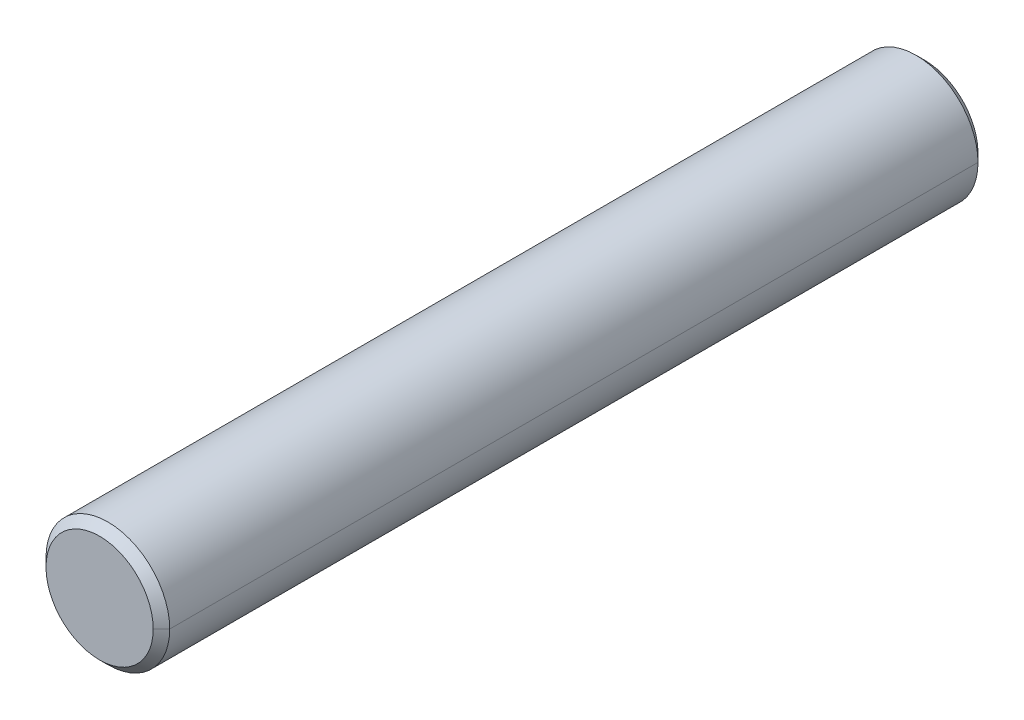
ISO-10303-21;
HEADER;
FILE_DESCRIPTION(('STEP AP214'),'2;1');
FILE_NAME('part.step','',(''),(''),'','','');
FILE_SCHEMA(('AUTOMOTIVE_DESIGN { 1 0 10303 214 1 1 1 1 }'));
ENDSEC;
DATA;
#1=APPLICATION_CONTEXT('core data for automotive mechanical design processes');
#2=APPLICATION_PROTOCOL_DEFINITION('international standard','automotive_design',2000,#1);
#3=PRODUCT_CONTEXT('',#1,'mechanical');
#4=PRODUCT('Part','Part','',(#3));
#5=PRODUCT_RELATED_PRODUCT_CATEGORY('part','',(#4));
#6=PRODUCT_DEFINITION_FORMATION('','',#4);
#7=PRODUCT_DEFINITION_CONTEXT('part definition',#1,'design');
#8=PRODUCT_DEFINITION('design','',#6,#7);
#9=PRODUCT_DEFINITION_SHAPE('','',#8);
#10=(LENGTH_UNIT() NAMED_UNIT(*) SI_UNIT(.MILLI.,.METRE.));
#11=(NAMED_UNIT(*) PLANE_ANGLE_UNIT() SI_UNIT($,.RADIAN.));
#12=(NAMED_UNIT(*) SI_UNIT($,.STERADIAN.) SOLID_ANGLE_UNIT());
#13=UNCERTAINTY_MEASURE_WITH_UNIT(LENGTH_MEASURE(1.E-05),#10,'distance_accuracy_value','');
#14=(GEOMETRIC_REPRESENTATION_CONTEXT(3) GLOBAL_UNCERTAINTY_ASSIGNED_CONTEXT((#13)) GLOBAL_UNIT_ASSIGNED_CONTEXT((#10,
#11,#12)) REPRESENTATION_CONTEXT('',''));
#15=CARTESIAN_POINT('',(0.,0.,0.));
#16=DIRECTION('',(0.,0.,1.));
#17=DIRECTION('',(1.,0.,0.));
#18=AXIS2_PLACEMENT_3D('',#15,#16,#17);
#19=CARTESIAN_POINT('',(0.,0.,0.));
#20=DIRECTION('',(0.,0.,1.));
#21=DIRECTION('',(1.,0.,0.));
#22=AXIS2_PLACEMENT_3D('',#19,#20,#21);
#23=PLANE('',#22);
#24=CARTESIAN_POINT('',(0.,0.,0.));
#25=DIRECTION('',(0.,0.,-1.));
#26=DIRECTION('',(1.,0.,0.));
#27=AXIS2_PLACEMENT_3D('',#24,#25,#26);
#28=CIRCLE('',#27,1.3);
#29=CARTESIAN_POINT('',(1.3,0.,0.));
#30=VERTEX_POINT('',#29);
#31=CARTESIAN_POINT('',(-1.3,0.,0.));
#32=VERTEX_POINT('',#31);
#33=EDGE_CURVE('E11',#30,#32,#28,.T.);
#34=ORIENTED_EDGE('',*,*,#33,.T.);
#35=CARTESIAN_POINT('',(0.,0.,0.));
#36=DIRECTION('',(0.,0.,-1.));
#37=DIRECTION('',(1.,0.,0.));
#38=AXIS2_PLACEMENT_3D('',#35,#36,#37);
#39=CIRCLE('',#38,1.3);
#40=EDGE_CURVE('E113',#32,#30,#39,.T.);
#41=ORIENTED_EDGE('',*,*,#40,.T.);
#42=EDGE_LOOP('',(#34,#41));
#43=FACE_BOUND('',#42,.T.);
#44=ADVANCED_FACE('F17',(#43),#23,.F.);
#45=CARTESIAN_POINT('',(0.,0.,0.2));
#46=DIRECTION('',(0.,0.,1.));
#47=DIRECTION('',(1.,0.,0.));
#48=AXIS2_PLACEMENT_3D('',#45,#46,#47);
#49=CONICAL_SURFACE('',#48,1.5,0.785398163397);
#50=DIRECTION('',(-0.707106781186548,0.,0.707106781186548));
#51=VECTOR('',#50,1.);
#52=CARTESIAN_POINT('',(-3535534.65593,4.32978119966E-10,3535533.35593));
#53=LINE('',#52,#51);
#54=CARTESIAN_POINT('',(-1.5,0.,0.2));
#55=VERTEX_POINT('',#54);
#56=EDGE_CURVE('E147',#32,#55,#53,.T.);
#57=ORIENTED_EDGE('',*,*,#56,.F.);
#58=ORIENTED_EDGE('',*,*,#33,.F.);
#59=DIRECTION('',(0.707106781186548,0.,0.707106781186548));
#60=VECTOR('',#59,1.);
#61=CARTESIAN_POINT('',(3535534.65593,0.,3535533.35593));
#62=LINE('',#61,#60);
#63=CARTESIAN_POINT('',(1.5,0.,0.2));
#64=VERTEX_POINT('',#63);
#65=EDGE_CURVE('E28',#30,#64,#62,.T.);
#66=ORIENTED_EDGE('',*,*,#65,.T.);
#67=CARTESIAN_POINT('',(0.,0.,0.199999999254998));
#68=DIRECTION('',(0.,0.,1.));
#69=DIRECTION('',(-1.,0.,0.));
#70=AXIS2_PLACEMENT_3D('',#67,#68,#69);
#71=CIRCLE('',#70,1.5);
#72=EDGE_CURVE('E81',#55,#64,#71,.T.);
#73=ORIENTED_EDGE('',*,*,#72,.F.);
#74=EDGE_LOOP('',(#57,#58,#66,#73));
#75=FACE_BOUND('',#74,.T.);
#76=ADVANCED_FACE('F131',(#75),#49,.T.);
#77=CARTESIAN_POINT('',(0.,0.,0.2));
#78=DIRECTION('',(0.,0.,1.));
#79=DIRECTION('',(1.,0.,0.));
#80=AXIS2_PLACEMENT_3D('',#77,#78,#79);
#81=CONICAL_SURFACE('',#80,1.5,0.785398163397);
#82=ORIENTED_EDGE('',*,*,#40,.F.);
#83=ORIENTED_EDGE('',*,*,#56,.T.);
#84=CARTESIAN_POINT('',(0.,0.,0.199999999255));
#85=DIRECTION('',(0.,0.,1.));
#86=DIRECTION('',(1.,0.,0.));
#87=AXIS2_PLACEMENT_3D('',#84,#85,#86);
#88=CIRCLE('',#87,1.5);
#89=EDGE_CURVE('E78',#64,#55,#88,.T.);
#90=ORIENTED_EDGE('',*,*,#89,.F.);
#91=ORIENTED_EDGE('',*,*,#65,.F.);
#92=EDGE_LOOP('',(#82,#83,#90,#91));
#93=FACE_BOUND('',#92,.T.);
#94=ADVANCED_FACE('F130',(#93),#81,.T.);
#95=CARTESIAN_POINT('',(0.,0.,20.));
#96=DIRECTION('',(0.,0.,-1.));
#97=DIRECTION('',(-1.,0.,0.));
#98=AXIS2_PLACEMENT_3D('',#95,#96,#97);
#99=CYLINDRICAL_SURFACE('',#98,1.5);
#100=DIRECTION('',(0.,0.,-1.));
#101=VECTOR('',#100,1.);
#102=CARTESIAN_POINT('',(1.5,0.,20.));
#103=LINE('',#102,#101);
#104=CARTESIAN_POINT('',(1.5,0.,19.8));
#105=VERTEX_POINT('',#104);
#106=EDGE_CURVE('E87',#105,#64,#103,.T.);
#107=ORIENTED_EDGE('',*,*,#106,.F.);
#108=CARTESIAN_POINT('',(0.,0.,19.8));
#109=DIRECTION('',(0.,0.,-1.));
#110=DIRECTION('',(1.,0.,0.));
#111=AXIS2_PLACEMENT_3D('',#108,#109,#110);
#112=CIRCLE('',#111,1.5);
#113=CARTESIAN_POINT('',(-1.5,0.,19.8));
#114=VERTEX_POINT('',#113);
#115=EDGE_CURVE('E84',#105,#114,#112,.T.);
#116=ORIENTED_EDGE('',*,*,#115,.T.);
#117=DIRECTION('',(0.,0.,-1.));
#118=VECTOR('',#117,1.);
#119=CARTESIAN_POINT('',(-1.5,0.,20.));
#120=LINE('',#119,#118);
#121=EDGE_CURVE('E71',#114,#55,#120,.T.);
#122=ORIENTED_EDGE('',*,*,#121,.T.);
#123=ORIENTED_EDGE('',*,*,#72,.T.);
#124=EDGE_LOOP('',(#107,#116,#122,#123));
#125=FACE_BOUND('',#124,.T.);
#126=ADVANCED_FACE('F86',(#125),#99,.T.);
#127=CARTESIAN_POINT('',(0.,0.,20.));
#128=DIRECTION('',(0.,0.,-1.));
#129=DIRECTION('',(-1.,0.,0.));
#130=AXIS2_PLACEMENT_3D('',#127,#128,#129);
#131=CYLINDRICAL_SURFACE('',#130,1.5);
#132=CARTESIAN_POINT('',(0.,0.,19.8));
#133=DIRECTION('',(0.,0.,-1.));
#134=DIRECTION('',(1.,0.,0.));
#135=AXIS2_PLACEMENT_3D('',#132,#133,#134);
#136=CIRCLE('',#135,1.5);
#137=EDGE_CURVE('E75',#114,#105,#136,.T.);
#138=ORIENTED_EDGE('',*,*,#137,.T.);
#139=ORIENTED_EDGE('',*,*,#106,.T.);
#140=ORIENTED_EDGE('',*,*,#89,.T.);
#141=ORIENTED_EDGE('',*,*,#121,.F.);
#142=EDGE_LOOP('',(#138,#139,#140,#141));
#143=FACE_BOUND('',#142,.T.);
#144=ADVANCED_FACE('F19',(#143),#131,.T.);
#145=CARTESIAN_POINT('',(0.,0.,20.));
#146=DIRECTION('',(0.,0.,-1.));
#147=DIRECTION('',(-1.,0.,0.));
#148=AXIS2_PLACEMENT_3D('',#145,#146,#147);
#149=CONICAL_SURFACE('',#148,1.3,0.785398163397);
#150=DIRECTION('',(0.707106781186548,0.,-0.707106781186548));
#151=VECTOR('',#150,1.);
#152=CARTESIAN_POINT('',(3535534.55593,4.3297810772E-10,-3535513.25593));
#153=LINE('',#152,#151);
#154=CARTESIAN_POINT('',(1.3,0.,20.));
#155=VERTEX_POINT('',#154);
#156=EDGE_CURVE('E102',#155,#105,#153,.T.);
#157=ORIENTED_EDGE('',*,*,#156,.F.);
#158=CARTESIAN_POINT('',(0.,0.,20.));
#159=DIRECTION('',(0.,0.,1.));
#160=DIRECTION('',(1.,0.,0.));
#161=AXIS2_PLACEMENT_3D('',#158,#159,#160);
#162=CIRCLE('',#161,1.30000000075);
#163=CARTESIAN_POINT('',(-1.3,0.,20.));
#164=VERTEX_POINT('',#163);
#165=EDGE_CURVE('E91',#164,#155,#162,.T.);
#166=ORIENTED_EDGE('',*,*,#165,.F.);
#167=DIRECTION('',(-0.707106781186548,0.,-0.707106781186548));
#168=VECTOR('',#167,1.);
#169=CARTESIAN_POINT('',(-3535534.55593,0.,-3535513.25593));
#170=LINE('',#169,#168);
#171=EDGE_CURVE('E94',#164,#114,#170,.T.);
#172=ORIENTED_EDGE('',*,*,#171,.T.);
#173=ORIENTED_EDGE('',*,*,#115,.F.);
#174=EDGE_LOOP('',(#157,#166,#172,#173));
#175=FACE_BOUND('',#174,.T.);
#176=ADVANCED_FACE('F95',(#175),#149,.T.);
#177=CARTESIAN_POINT('',(0.,0.,20.));
#178=DIRECTION('',(0.,0.,1.));
#179=DIRECTION('',(1.,0.,0.));
#180=AXIS2_PLACEMENT_3D('',#177,#178,#179);
#181=PLANE('',#180);
#182=ORIENTED_EDGE('',*,*,#165,.T.);
#183=CARTESIAN_POINT('',(0.,0.,20.));
#184=DIRECTION('',(0.,0.,1.));
#185=DIRECTION('',(1.,0.,0.));
#186=AXIS2_PLACEMENT_3D('',#183,#184,#185);
#187=CIRCLE('',#186,1.3);
#188=EDGE_CURVE('E109',#155,#164,#187,.T.);
#189=ORIENTED_EDGE('',*,*,#188,.T.);
#190=EDGE_LOOP('',(#182,#189));
#191=FACE_BOUND('',#190,.T.);
#192=ADVANCED_FACE('F136',(#191),#181,.T.);
#193=CARTESIAN_POINT('',(0.,0.,20.));
#194=DIRECTION('',(0.,0.,-1.));
#195=DIRECTION('',(-1.,0.,0.));
#196=AXIS2_PLACEMENT_3D('',#193,#194,#195);
#197=CONICAL_SURFACE('',#196,1.3,0.785398163397);
#198=ORIENTED_EDGE('',*,*,#188,.F.);
#199=ORIENTED_EDGE('',*,*,#156,.T.);
#200=ORIENTED_EDGE('',*,*,#137,.F.);
#201=ORIENTED_EDGE('',*,*,#171,.F.);
#202=EDGE_LOOP('',(#198,#199,#200,#201));
#203=FACE_BOUND('',#202,.T.);
#204=ADVANCED_FACE('F101',(#203),#197,.T.);
#205=CLOSED_SHELL('',(#44,#76,#94,#126,#144,#176,#192,#204));
#206=MANIFOLD_SOLID_BREP('B1',#205);
#207=ADVANCED_BREP_SHAPE_REPRESENTATION('',(#18,#206),#14);
#208=SHAPE_DEFINITION_REPRESENTATION(#9,#207);
ENDSEC;
END-ISO-10303-21;
